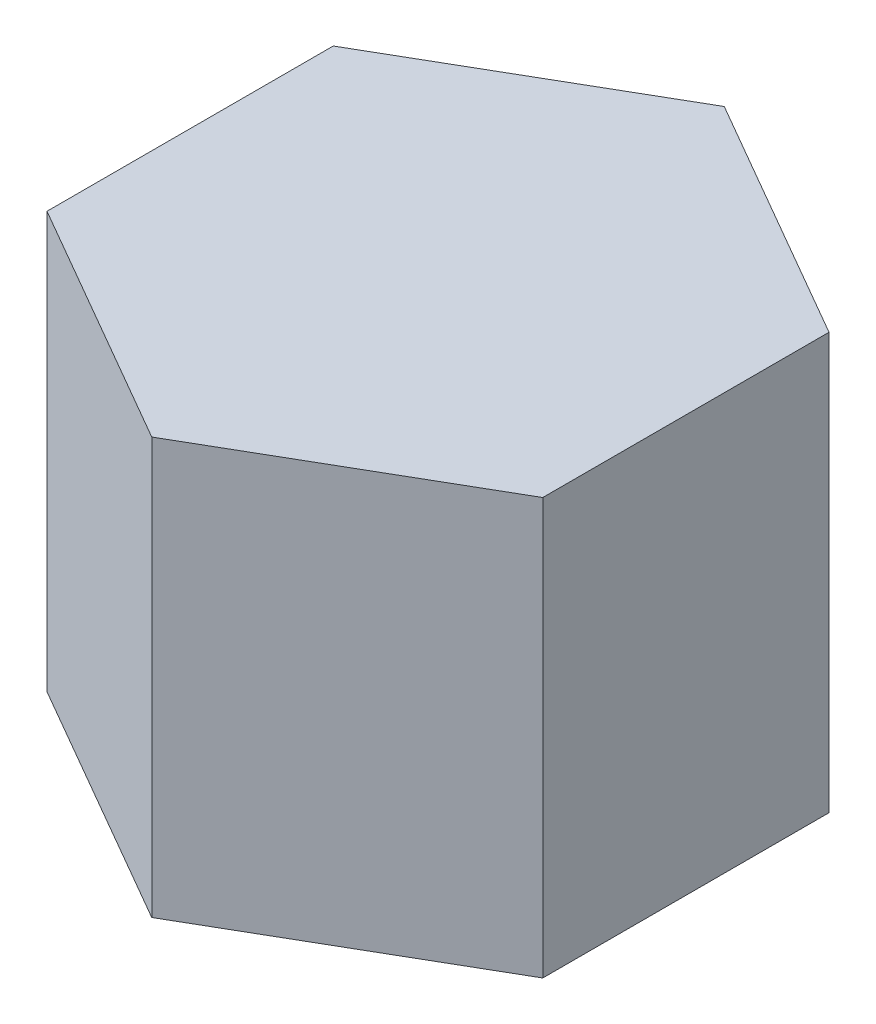
ISO-10303-21;
HEADER;
FILE_DESCRIPTION(('STEP AP214'),'2;1');
FILE_NAME('part.step','',(''),(''),'','','');
FILE_SCHEMA(('AUTOMOTIVE_DESIGN { 1 0 10303 214 1 1 1 1 }'));
ENDSEC;
DATA;
#1=APPLICATION_CONTEXT('core data for automotive mechanical design processes');
#2=APPLICATION_PROTOCOL_DEFINITION('international standard','automotive_design',2000,#1);
#3=PRODUCT_CONTEXT('',#1,'mechanical');
#4=PRODUCT('Part','Part','',(#3));
#5=PRODUCT_RELATED_PRODUCT_CATEGORY('part','',(#4));
#6=PRODUCT_DEFINITION_FORMATION('','',#4);
#7=PRODUCT_DEFINITION_CONTEXT('part definition',#1,'design');
#8=PRODUCT_DEFINITION('design','',#6,#7);
#9=PRODUCT_DEFINITION_SHAPE('','',#8);
#10=(LENGTH_UNIT() NAMED_UNIT(*) SI_UNIT(.MILLI.,.METRE.));
#11=(NAMED_UNIT(*) PLANE_ANGLE_UNIT() SI_UNIT($,.RADIAN.));
#12=(NAMED_UNIT(*) SI_UNIT($,.STERADIAN.) SOLID_ANGLE_UNIT());
#13=UNCERTAINTY_MEASURE_WITH_UNIT(LENGTH_MEASURE(1.E-05),#10,'distance_accuracy_value','');
#14=(GEOMETRIC_REPRESENTATION_CONTEXT(3) GLOBAL_UNCERTAINTY_ASSIGNED_CONTEXT((#13)) GLOBAL_UNIT_ASSIGNED_CONTEXT((#10,
#11,#12)) REPRESENTATION_CONTEXT('',''));
#15=CARTESIAN_POINT('',(0.,0.,0.));
#16=DIRECTION('',(0.,0.,1.));
#17=DIRECTION('',(1.,0.,0.));
#18=AXIS2_PLACEMENT_3D('',#15,#16,#17);
#19=CARTESIAN_POINT('',(205.839551417382,-147.556598747966,292.547996624279));
#20=DIRECTION('',(-0.500000000000096,0.,-0.866025403784383));
#21=DIRECTION('',(-0.866025403784383,0.,0.500000000000096));
#22=AXIS2_PLACEMENT_3D('',#19,#20,#21);
#23=PLANE('',#22);
#24=CARTESIAN_POINT('',(206.142660308706,-147.047793579175,292.372996624279));
#25=DIRECTION('',(-0.866025403784383,0.,0.500000000000096));
#26=VECTOR('',#25,1.);
#27=LINE('',#24,#26);
#28=CARTESIAN_POINT('',(206.142660308706,-147.047793579175,292.372996624279));
#29=VERTEX_POINT('',#28);
#30=CARTESIAN_POINT('',(205.839551417382,-147.047793579175,292.547996624279));
#31=VERTEX_POINT('',#30);
#32=EDGE_CURVE('E170',#29,#31,#27,.T.);
#33=ORIENTED_EDGE('',*,*,#32,.T.);
#34=CARTESIAN_POINT('',(205.839551417382,-147.556598747966,292.547996624279));
#35=DIRECTION('',(0.,1.,0.));
#36=VECTOR('',#35,1.);
#37=LINE('',#34,#36);
#38=CARTESIAN_POINT('',(205.839551417382,-147.556598747966,292.547996624279));
#39=VERTEX_POINT('',#38);
#40=EDGE_CURVE('E35',#39,#31,#37,.T.);
#41=ORIENTED_EDGE('',*,*,#40,.F.);
#42=CARTESIAN_POINT('',(206.142660308706,-147.556598747966,292.372996624279));
#43=DIRECTION('',(-0.866025403784383,0.,0.500000000000096));
#44=VECTOR('',#43,1.);
#45=LINE('',#42,#44);
#46=CARTESIAN_POINT('',(206.142660308706,-147.556598747966,292.372996624279));
#47=VERTEX_POINT('',#46);
#48=EDGE_CURVE('E159',#47,#39,#45,.T.);
#49=ORIENTED_EDGE('',*,*,#48,.F.);
#50=CARTESIAN_POINT('',(206.142660308706,-147.556598747966,292.372996624279));
#51=DIRECTION('',(0.,1.,0.));
#52=VECTOR('',#51,1.);
#53=LINE('',#50,#52);
#54=EDGE_CURVE('E10',#47,#29,#53,.T.);
#55=ORIENTED_EDGE('',*,*,#54,.T.);
#56=EDGE_LOOP('',(#33,#41,#49,#55));
#57=FACE_BOUND('',#56,.T.);
#58=ADVANCED_FACE('F16',(#57),#23,.F.);
#59=CARTESIAN_POINT('',(206.142660308706,-147.556598747966,291.594471220494));
#60=DIRECTION('',(-1.,0.,0.));
#61=DIRECTION('',(0.,-1.,0.));
#62=AXIS2_PLACEMENT_3D('',#59,#60,#61);
#63=PLANE('',#62);
#64=CARTESIAN_POINT('',(206.142660308706,-147.047793579175,292.022996624279));
#65=DIRECTION('',(0.,0.,1.));
#66=VECTOR('',#65,1.);
#67=LINE('',#64,#66);
#68=CARTESIAN_POINT('',(206.142660308706,-147.047793579175,292.022996624279));
#69=VERTEX_POINT('',#68);
#70=EDGE_CURVE('E167',#69,#29,#67,.T.);
#71=ORIENTED_EDGE('',*,*,#70,.T.);
#72=ORIENTED_EDGE('',*,*,#54,.F.);
#73=CARTESIAN_POINT('',(206.142660308706,-147.556598747966,292.022996624279));
#74=DIRECTION('',(0.,0.,1.));
#75=VECTOR('',#74,1.);
#76=LINE('',#73,#75);
#77=CARTESIAN_POINT('',(206.142660308706,-147.556598747966,292.022996624279));
#78=VERTEX_POINT('',#77);
#79=EDGE_CURVE('E156',#78,#47,#76,.T.);
#80=ORIENTED_EDGE('',*,*,#79,.F.);
#81=CARTESIAN_POINT('',(206.142660308706,-147.556598747966,292.022996624279));
#82=DIRECTION('',(0.,1.,0.));
#83=VECTOR('',#82,1.);
#84=LINE('',#81,#83);
#85=EDGE_CURVE('E27',#78,#69,#84,.T.);
#86=ORIENTED_EDGE('',*,*,#85,.T.);
#87=EDGE_LOOP('',(#71,#72,#80,#86));
#88=FACE_BOUND('',#87,.T.);
#89=ADVANCED_FACE('F189',(#88),#63,.F.);
#90=CARTESIAN_POINT('',(206.142660308706,-147.556598747966,292.022996624279));
#91=DIRECTION('',(-0.500000000000062,0.,0.866025403784403));
#92=DIRECTION('',(0.866025403784403,0.,0.500000000000062));
#93=AXIS2_PLACEMENT_3D('',#90,#91,#92);
#94=PLANE('',#93);
#95=CARTESIAN_POINT('',(205.839551417381,-147.047793579175,291.847996624279));
#96=DIRECTION('',(0.866025403784403,0.,0.500000000000062));
#97=VECTOR('',#96,1.);
#98=LINE('',#95,#97);
#99=CARTESIAN_POINT('',(205.839551417382,-147.047793579175,291.847996624279));
#100=VERTEX_POINT('',#99);
#101=EDGE_CURVE('E163',#100,#69,#98,.T.);
#102=ORIENTED_EDGE('',*,*,#101,.T.);
#103=ORIENTED_EDGE('',*,*,#85,.F.);
#104=CARTESIAN_POINT('',(205.839551417381,-147.556598747966,291.847996624279));
#105=DIRECTION('',(0.866025403784403,0.,0.500000000000062));
#106=VECTOR('',#105,1.);
#107=LINE('',#104,#106);
#108=CARTESIAN_POINT('',(205.839551417382,-147.556598747966,291.847996624279));
#109=VERTEX_POINT('',#108);
#110=EDGE_CURVE('E106',#109,#78,#107,.T.);
#111=ORIENTED_EDGE('',*,*,#110,.F.);
#112=CARTESIAN_POINT('',(205.839551417382,-147.556598747966,291.847996624279));
#113=DIRECTION('',(0.,1.,0.));
#114=VECTOR('',#113,1.);
#115=LINE('',#112,#114);
#116=EDGE_CURVE('E94',#109,#100,#115,.T.);
#117=ORIENTED_EDGE('',*,*,#116,.T.);
#118=EDGE_LOOP('',(#102,#103,#111,#117));
#119=FACE_BOUND('',#118,.T.);
#120=ADVANCED_FACE('F198',(#119),#94,.F.);
#121=CARTESIAN_POINT('',(205.839551417382,-147.556598747966,291.847996624279));
#122=DIRECTION('',(0.499999999999943,0.,0.866025403784471));
#123=DIRECTION('',(0.866025403784471,0.,-0.499999999999943));
#124=AXIS2_PLACEMENT_3D('',#121,#122,#123);
#125=PLANE('',#124);
#126=CARTESIAN_POINT('',(205.536442526057,-147.047793579175,292.022996624279));
#127=DIRECTION('',(0.866025403784471,0.,-0.499999999999943));
#128=VECTOR('',#127,1.);
#129=LINE('',#126,#128);
#130=CARTESIAN_POINT('',(205.536442526057,-147.047793579175,292.022996624279));
#131=VERTEX_POINT('',#130);
#132=EDGE_CURVE('E162',#131,#100,#129,.T.);
#133=ORIENTED_EDGE('',*,*,#132,.T.);
#134=ORIENTED_EDGE('',*,*,#116,.F.);
#135=CARTESIAN_POINT('',(205.536442526057,-147.556598747966,292.022996624279));
#136=DIRECTION('',(0.866025403784471,0.,-0.499999999999943));
#137=VECTOR('',#136,1.);
#138=LINE('',#135,#137);
#139=CARTESIAN_POINT('',(205.536442526057,-147.556598747966,292.022996624279));
#140=VERTEX_POINT('',#139);
#141=EDGE_CURVE('E98',#140,#109,#138,.T.);
#142=ORIENTED_EDGE('',*,*,#141,.F.);
#143=CARTESIAN_POINT('',(205.536442526057,-147.556598747966,292.022996624279));
#144=DIRECTION('',(0.,1.,0.));
#145=VECTOR('',#144,1.);
#146=LINE('',#143,#145);
#147=EDGE_CURVE('E79',#140,#131,#146,.T.);
#148=ORIENTED_EDGE('',*,*,#147,.T.);
#149=EDGE_LOOP('',(#133,#134,#142,#148));
#150=FACE_BOUND('',#149,.T.);
#151=ADVANCED_FACE('F100',(#150),#125,.F.);
#152=CARTESIAN_POINT('',(205.536442526057,-147.556598747966,291.594471220494));
#153=DIRECTION('',(1.,0.,0.));
#154=DIRECTION('',(0.,1.,0.));
#155=AXIS2_PLACEMENT_3D('',#152,#153,#154);
#156=PLANE('',#155);
#157=CARTESIAN_POINT('',(205.536442526057,-147.047793579175,292.372996624279));
#158=DIRECTION('',(0.,0.,-1.));
#159=VECTOR('',#158,1.);
#160=LINE('',#157,#159);
#161=CARTESIAN_POINT('',(205.536442526057,-147.047793579175,292.372996624279));
#162=VERTEX_POINT('',#161);
#163=EDGE_CURVE('E88',#162,#131,#160,.T.);
#164=ORIENTED_EDGE('',*,*,#163,.T.);
#165=ORIENTED_EDGE('',*,*,#147,.F.);
#166=CARTESIAN_POINT('',(205.536442526057,-147.556598747966,292.372996624279));
#167=DIRECTION('',(0.,0.,-1.));
#168=VECTOR('',#167,1.);
#169=LINE('',#166,#168);
#170=CARTESIAN_POINT('',(205.536442526057,-147.556598747966,292.372996624279));
#171=VERTEX_POINT('',#170);
#172=EDGE_CURVE('E84',#171,#140,#169,.T.);
#173=ORIENTED_EDGE('',*,*,#172,.F.);
#174=CARTESIAN_POINT('',(205.536442526057,-147.556598747966,292.372996624279));
#175=DIRECTION('',(0.,1.,0.));
#176=VECTOR('',#175,1.);
#177=LINE('',#174,#176);
#178=EDGE_CURVE('E58',#171,#162,#177,.T.);
#179=ORIENTED_EDGE('',*,*,#178,.T.);
#180=EDGE_LOOP('',(#164,#165,#173,#179));
#181=FACE_BOUND('',#180,.T.);
#182=ADVANCED_FACE('F82',(#181),#156,.F.);
#183=CARTESIAN_POINT('',(205.536442526057,-147.556598747966,292.372996624279));
#184=DIRECTION('',(0.500000000000062,0.,-0.866025403784403));
#185=DIRECTION('',(-0.866025403784403,0.,-0.500000000000062));
#186=AXIS2_PLACEMENT_3D('',#183,#184,#185);
#187=PLANE('',#186);
#188=CARTESIAN_POINT('',(205.839551417382,-147.047793579175,292.547996624279));
#189=DIRECTION('',(-0.866025403784403,0.,-0.500000000000062));
#190=VECTOR('',#189,1.);
#191=LINE('',#188,#190);
#192=EDGE_CURVE('E160',#31,#162,#191,.T.);
#193=ORIENTED_EDGE('',*,*,#192,.T.);
#194=ORIENTED_EDGE('',*,*,#178,.F.);
#195=CARTESIAN_POINT('',(205.839551417382,-147.556598747966,292.547996624279));
#196=DIRECTION('',(-0.866025403784403,0.,-0.500000000000062));
#197=VECTOR('',#196,1.);
#198=LINE('',#195,#197);
#199=EDGE_CURVE('E112',#39,#171,#198,.T.);
#200=ORIENTED_EDGE('',*,*,#199,.F.);
#201=ORIENTED_EDGE('',*,*,#40,.T.);
#202=EDGE_LOOP('',(#193,#194,#200,#201));
#203=FACE_BOUND('',#202,.T.);
#204=ADVANCED_FACE('F131',(#203),#187,.F.);
#205=CARTESIAN_POINT('',(206.491105863044,-147.556598747966,291.594471220494));
#206=DIRECTION('',(0.,1.,0.));
#207=DIRECTION('',(-1.,0.,0.));
#208=AXIS2_PLACEMENT_3D('',#205,#206,#207);
#209=PLANE('',#208);
#210=ORIENTED_EDGE('',*,*,#48,.T.);
#211=ORIENTED_EDGE('',*,*,#199,.T.);
#212=ORIENTED_EDGE('',*,*,#172,.T.);
#213=ORIENTED_EDGE('',*,*,#141,.T.);
#214=ORIENTED_EDGE('',*,*,#110,.T.);
#215=ORIENTED_EDGE('',*,*,#79,.T.);
#216=EDGE_LOOP('',(#210,#211,#212,#213,#214,#215));
#217=FACE_BOUND('',#216,.T.);
#218=ADVANCED_FACE('F111',(#217),#209,.F.);
#219=CARTESIAN_POINT('',(206.491105863044,-147.047793579175,291.594471220494));
#220=DIRECTION('',(0.,1.,0.));
#221=DIRECTION('',(-1.,0.,0.));
#222=AXIS2_PLACEMENT_3D('',#219,#220,#221);
#223=PLANE('',#222);
#224=ORIENTED_EDGE('',*,*,#32,.F.);
#225=ORIENTED_EDGE('',*,*,#70,.F.);
#226=ORIENTED_EDGE('',*,*,#101,.F.);
#227=ORIENTED_EDGE('',*,*,#132,.F.);
#228=ORIENTED_EDGE('',*,*,#163,.F.);
#229=ORIENTED_EDGE('',*,*,#192,.F.);
#230=EDGE_LOOP('',(#224,#225,#226,#227,#228,#229));
#231=FACE_BOUND('',#230,.T.);
#232=ADVANCED_FACE('F130',(#231),#223,.T.);
#233=CLOSED_SHELL('',(#58,#89,#120,#151,#182,#204,#218,#232));
#234=MANIFOLD_SOLID_BREP('B1',#233);
#235=ADVANCED_BREP_SHAPE_REPRESENTATION('',(#18,#234),#14);
#236=SHAPE_DEFINITION_REPRESENTATION(#9,#235);
ENDSEC;
END-ISO-10303-21;
